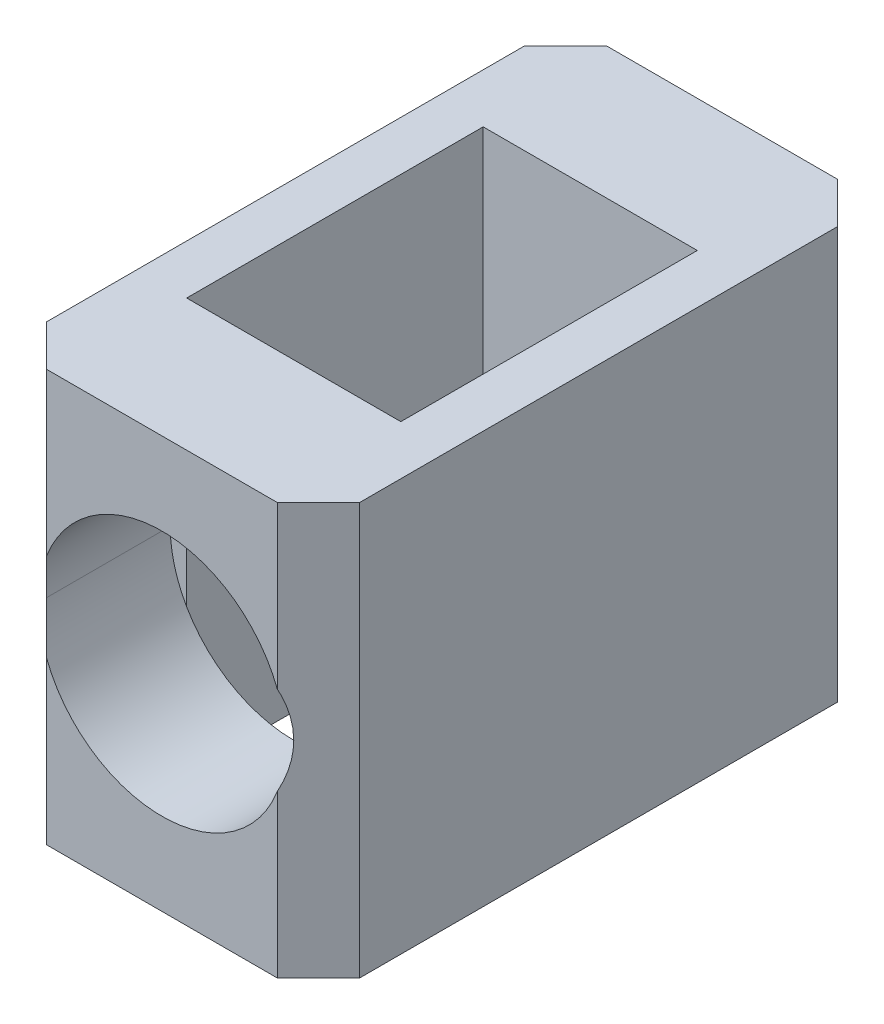
ISO-10303-21;
HEADER;
FILE_DESCRIPTION(('STEP AP214'),'2;1');
FILE_NAME('part.step','',(''),(''),'','','');
FILE_SCHEMA(('AUTOMOTIVE_DESIGN { 1 0 10303 214 1 1 1 1 }'));
ENDSEC;
DATA;
#1=APPLICATION_CONTEXT('core data for automotive mechanical design processes');
#2=APPLICATION_PROTOCOL_DEFINITION('international standard','automotive_design',2000,#1);
#3=PRODUCT_CONTEXT('',#1,'mechanical');
#4=PRODUCT('Part','Part','',(#3));
#5=PRODUCT_RELATED_PRODUCT_CATEGORY('part','',(#4));
#6=PRODUCT_DEFINITION_FORMATION('','',#4);
#7=PRODUCT_DEFINITION_CONTEXT('part definition',#1,'design');
#8=PRODUCT_DEFINITION('design','',#6,#7);
#9=PRODUCT_DEFINITION_SHAPE('','',#8);
#10=(LENGTH_UNIT() NAMED_UNIT(*) SI_UNIT(.MILLI.,.METRE.));
#11=(NAMED_UNIT(*) PLANE_ANGLE_UNIT() SI_UNIT($,.RADIAN.));
#12=(NAMED_UNIT(*) SI_UNIT($,.STERADIAN.) SOLID_ANGLE_UNIT());
#13=UNCERTAINTY_MEASURE_WITH_UNIT(LENGTH_MEASURE(1.E-05),#10,'distance_accuracy_value','');
#14=(GEOMETRIC_REPRESENTATION_CONTEXT(3) GLOBAL_UNCERTAINTY_ASSIGNED_CONTEXT((#13)) GLOBAL_UNIT_ASSIGNED_CONTEXT((#10,
#11,#12)) REPRESENTATION_CONTEXT('',''));
#15=CARTESIAN_POINT('',(0.,0.,0.));
#16=DIRECTION('',(0.,0.,1.));
#17=DIRECTION('',(1.,0.,0.));
#18=AXIS2_PLACEMENT_3D('',#15,#16,#17);
#19=CARTESIAN_POINT('',(17.7799999999997,5.27000000000021,8.43));
#20=DIRECTION('',(0.,0.,-1.));
#21=DIRECTION('',(-1.,0.,0.));
#22=AXIS2_PLACEMENT_3D('',#19,#20,#21);
#23=CYLINDRICAL_SURFACE('',#22,1.5);
#24=DIRECTION('',(0.,0.,1.));
#25=VECTOR('',#24,1.);
#26=CARTESIAN_POINT('',(16.2800000000003,5.26999999999963,8.43));
#27=LINE('',#26,#25);
#28=CARTESIAN_POINT('',(16.2800000000003,5.26999999999963,6.83));
#29=VERTEX_POINT('',#28);
#30=CARTESIAN_POINT('',(16.2800000000003,5.26999999999963,8.33));
#31=VERTEX_POINT('',#30);
#32=EDGE_CURVE('E227',#29,#31,#27,.T.);
#33=ORIENTED_EDGE('',*,*,#32,.F.);
#34=CARTESIAN_POINT('',(17.7799999999997,5.27000000000021,6.82999999999992));
#35=DIRECTION('',(0.,0.,1.));
#36=DIRECTION('',(-1.,0.,0.));
#37=AXIS2_PLACEMENT_3D('',#34,#35,#36);
#38=CIRCLE('',#37,1.5);
#39=CARTESIAN_POINT('',(16.48,6.01833147735468,6.83));
#40=VERTEX_POINT('',#39);
#41=EDGE_CURVE('E28',#40,#29,#38,.T.);
#42=ORIENTED_EDGE('',*,*,#41,.F.);
#43=CARTESIAN_POINT('',(17.7799999999997,5.27000000000021,6.83));
#44=DIRECTION('',(0.,0.,1.));
#45=DIRECTION('',(-1.,0.,0.));
#46=AXIS2_PLACEMENT_3D('',#43,#44,#45);
#47=CIRCLE('',#46,1.5);
#48=CARTESIAN_POINT('',(19.08,6.01833147735475,6.82999999999989));
#49=VERTEX_POINT('',#48);
#50=EDGE_CURVE('E304',#49,#40,#47,.T.);
#51=ORIENTED_EDGE('',*,*,#50,.F.);
#52=CARTESIAN_POINT('',(17.7799999999997,5.27000000000021,6.82999999999992));
#53=DIRECTION('',(0.,0.,1.));
#54=DIRECTION('',(-1.,0.,0.));
#55=AXIS2_PLACEMENT_3D('',#52,#53,#54);
#56=CIRCLE('',#55,1.5);
#57=CARTESIAN_POINT('',(19.28,5.27000000000007,6.82999999999989));
#58=VERTEX_POINT('',#57);
#59=EDGE_CURVE('E11',#58,#49,#56,.T.);
#60=ORIENTED_EDGE('',*,*,#59,.F.);
#61=DIRECTION('',(0.,0.,1.));
#62=VECTOR('',#61,1.);
#63=CARTESIAN_POINT('',(19.28,5.27000000000007,8.43));
#64=LINE('',#63,#62);
#65=CARTESIAN_POINT('',(19.28,5.27000000000007,8.32999999999989));
#66=VERTEX_POINT('',#65);
#67=EDGE_CURVE('E238',#58,#66,#64,.T.);
#68=ORIENTED_EDGE('',*,*,#67,.T.);
#69=CARTESIAN_POINT('',(17.7799999999997,5.27000000000021,9.83));
#70=DIRECTION('',(0.707106781186561,0.,0.707106781186534));
#71=DIRECTION('',(-0.707106781186534,0.,0.707106781186561));
#72=AXIS2_PLACEMENT_3D('',#69,#70,#71);
#73=ELLIPSE('',#72,2.12132034355964,1.5);
#74=CARTESIAN_POINT('',(19.18,5.80851648071365,8.43));
#75=VERTEX_POINT('',#74);
#76=EDGE_CURVE('E222',#66,#75,#73,.T.);
#77=ORIENTED_EDGE('',*,*,#76,.T.);
#78=CARTESIAN_POINT('',(17.7799999999997,5.27000000000021,8.43));
#79=DIRECTION('',(0.,0.,1.));
#80=DIRECTION('',(-1.,0.,0.));
#81=AXIS2_PLACEMENT_3D('',#78,#79,#80);
#82=CIRCLE('',#81,1.5);
#83=CARTESIAN_POINT('',(16.38,5.80851648071329,8.43));
#84=VERTEX_POINT('',#83);
#85=EDGE_CURVE('E299',#75,#84,#82,.T.);
#86=ORIENTED_EDGE('',*,*,#85,.T.);
#87=CARTESIAN_POINT('',(17.7799999999997,5.27000000000021,9.83));
#88=DIRECTION('',(-0.707106781186535,0.,0.70710678118656));
#89=DIRECTION('',(0.70710678118656,0.,0.707106781186535));
#90=AXIS2_PLACEMENT_3D('',#87,#88,#89);
#91=ELLIPSE('',#90,2.12132034355964,1.5);
#92=EDGE_CURVE('E286',#84,#31,#91,.T.);
#93=ORIENTED_EDGE('',*,*,#92,.T.);
#94=EDGE_LOOP('',(#33,#42,#51,#60,#68,#77,#86,#93));
#95=FACE_BOUND('',#94,.T.);
#96=ADVANCED_FACE('F17',(#95),#23,.F.);
#97=CARTESIAN_POINT('',(19.1050000000003,5.26999999999963,6.82999999999989));
#98=DIRECTION('',(0.,0.,1.));
#99=DIRECTION('',(1.,0.,0.));
#100=AXIS2_PLACEMENT_3D('',#97,#98,#99);
#101=PLANE('',#100);
#102=DIRECTION('',(0.,-1.,0.));
#103=VECTOR('',#102,1.);
#104=CARTESIAN_POINT('',(19.08,2.77000000000016,6.82999999999989));
#105=LINE('',#104,#103);
#106=CARTESIAN_POINT('',(19.08,4.52166852264494,6.82999999999989));
#107=VERTEX_POINT('',#106);
#108=EDGE_CURVE('E265',#49,#107,#105,.T.);
#109=ORIENTED_EDGE('',*,*,#108,.T.);
#110=CARTESIAN_POINT('',(17.7799999999997,5.27000000000021,6.82999999999992));
#111=DIRECTION('',(0.,0.,1.));
#112=DIRECTION('',(-1.,0.,0.));
#113=AXIS2_PLACEMENT_3D('',#110,#111,#112);
#114=CIRCLE('',#113,1.5);
#115=EDGE_CURVE('E235',#107,#58,#114,.T.);
#116=ORIENTED_EDGE('',*,*,#115,.T.);
#117=ORIENTED_EDGE('',*,*,#59,.T.);
#118=EDGE_LOOP('',(#109,#116,#117));
#119=FACE_BOUND('',#118,.T.);
#120=ADVANCED_FACE('F435',(#119),#101,.T.);
#121=CARTESIAN_POINT('',(19.1050000000003,5.26999999999963,6.82999999999989));
#122=DIRECTION('',(0.,0.,1.));
#123=DIRECTION('',(1.,0.,0.));
#124=AXIS2_PLACEMENT_3D('',#121,#122,#123);
#125=PLANE('',#124);
#126=CARTESIAN_POINT('',(17.7799999999997,5.27000000000021,6.82999999999992));
#127=DIRECTION('',(0.,0.,1.));
#128=DIRECTION('',(-1.,0.,0.));
#129=AXIS2_PLACEMENT_3D('',#126,#127,#128);
#130=CIRCLE('',#129,1.5);
#131=CARTESIAN_POINT('',(16.48,4.52166852264501,6.83));
#132=VERTEX_POINT('',#131);
#133=EDGE_CURVE('E224',#29,#132,#130,.T.);
#134=ORIENTED_EDGE('',*,*,#133,.T.);
#135=DIRECTION('',(0.,1.,0.));
#136=VECTOR('',#135,1.);
#137=CARTESIAN_POINT('',(16.48,2.77000000000016,6.83));
#138=LINE('',#137,#136);
#139=EDGE_CURVE('E234',#132,#40,#138,.T.);
#140=ORIENTED_EDGE('',*,*,#139,.T.);
#141=ORIENTED_EDGE('',*,*,#41,.T.);
#142=EDGE_LOOP('',(#134,#140,#141));
#143=FACE_BOUND('',#142,.T.);
#144=ADVANCED_FACE('F370',(#143),#125,.T.);
#145=CARTESIAN_POINT('',(17.7799999999997,5.27000000000021,8.43));
#146=DIRECTION('',(0.,0.,-1.));
#147=DIRECTION('',(-1.,0.,0.));
#148=AXIS2_PLACEMENT_3D('',#145,#146,#147);
#149=CYLINDRICAL_SURFACE('',#148,1.5);
#150=ORIENTED_EDGE('',*,*,#133,.F.);
#151=ORIENTED_EDGE('',*,*,#32,.T.);
#152=CARTESIAN_POINT('',(17.7799999999997,5.27000000000021,9.83));
#153=DIRECTION('',(-0.707106781186535,0.,0.70710678118656));
#154=DIRECTION('',(0.70710678118656,0.,0.707106781186535));
#155=AXIS2_PLACEMENT_3D('',#152,#153,#154);
#156=ELLIPSE('',#155,2.12132034355964,1.5);
#157=CARTESIAN_POINT('',(16.38,4.73148351928682,8.43));
#158=VERTEX_POINT('',#157);
#159=EDGE_CURVE('E280',#31,#158,#156,.T.);
#160=ORIENTED_EDGE('',*,*,#159,.T.);
#161=CARTESIAN_POINT('',(17.7799999999997,5.27000000000021,8.43));
#162=DIRECTION('',(0.,0.,1.));
#163=DIRECTION('',(-1.,0.,0.));
#164=AXIS2_PLACEMENT_3D('',#161,#162,#163);
#165=CIRCLE('',#164,1.5);
#166=CARTESIAN_POINT('',(19.18,4.73148351928624,8.43));
#167=VERTEX_POINT('',#166);
#168=EDGE_CURVE('E239',#158,#167,#165,.T.);
#169=ORIENTED_EDGE('',*,*,#168,.T.);
#170=CARTESIAN_POINT('',(17.7799999999997,5.27000000000021,9.83));
#171=DIRECTION('',(0.707106781186561,0.,0.707106781186534));
#172=DIRECTION('',(-0.707106781186534,0.,0.707106781186561));
#173=AXIS2_PLACEMENT_3D('',#170,#171,#172);
#174=ELLIPSE('',#173,2.12132034355964,1.5);
#175=EDGE_CURVE('E277',#167,#66,#174,.T.);
#176=ORIENTED_EDGE('',*,*,#175,.T.);
#177=ORIENTED_EDGE('',*,*,#67,.F.);
#178=ORIENTED_EDGE('',*,*,#115,.F.);
#179=CARTESIAN_POINT('',(17.7799999999997,5.27000000000021,6.83));
#180=DIRECTION('',(0.,0.,1.));
#181=DIRECTION('',(-1.,0.,0.));
#182=AXIS2_PLACEMENT_3D('',#179,#180,#181);
#183=CIRCLE('',#182,1.5);
#184=EDGE_CURVE('E228',#132,#107,#183,.T.);
#185=ORIENTED_EDGE('',*,*,#184,.F.);
#186=EDGE_LOOP('',(#150,#151,#160,#169,#176,#177,#178,#185));
#187=FACE_BOUND('',#186,.T.);
#188=ADVANCED_FACE('F715',(#187),#149,.F.);
#189=CARTESIAN_POINT('',(18.7799999999996,7.77000000000033,6.83));
#190=DIRECTION('',(0.,0.,1.));
#191=DIRECTION('',(1.,0.,0.));
#192=AXIS2_PLACEMENT_3D('',#189,#190,#191);
#193=PLANE('',#192);
#194=ORIENTED_EDGE('',*,*,#184,.T.);
#195=DIRECTION('',(0.,1.,0.));
#196=VECTOR('',#195,1.);
#197=CARTESIAN_POINT('',(19.08,2.77000000000016,6.83));
#198=LINE('',#197,#196);
#199=CARTESIAN_POINT('',(19.08,2.77000000000016,6.83));
#200=VERTEX_POINT('',#199);
#201=EDGE_CURVE('E270',#200,#107,#198,.T.);
#202=ORIENTED_EDGE('',*,*,#201,.F.);
#203=DIRECTION('',(1.,0.,0.));
#204=VECTOR('',#203,1.);
#205=CARTESIAN_POINT('',(75.6910968965142,2.7700000000002,6.82999999999898));
#206=LINE('',#205,#204);
#207=CARTESIAN_POINT('',(16.48,2.77000000000016,6.83));
#208=VERTEX_POINT('',#207);
#209=EDGE_CURVE('E219',#208,#200,#206,.T.);
#210=ORIENTED_EDGE('',*,*,#209,.F.);
#211=DIRECTION('',(0.,1.,0.));
#212=VECTOR('',#211,1.);
#213=CARTESIAN_POINT('',(16.48,2.77000000000016,6.83));
#214=LINE('',#213,#212);
#215=EDGE_CURVE('E229',#208,#132,#214,.T.);
#216=ORIENTED_EDGE('',*,*,#215,.T.);
#217=EDGE_LOOP('',(#194,#202,#210,#216));
#218=FACE_BOUND('',#217,.T.);
#219=ADVANCED_FACE('F432',(#218),#193,.F.);
#220=CARTESIAN_POINT('',(16.1300000000003,5.26999999999964,8.18));
#221=DIRECTION('',(-0.707106781186534,0.,0.707106781186561));
#222=DIRECTION('',(0.,1.,0.));
#223=AXIS2_PLACEMENT_3D('',#220,#221,#222);
#224=PLANE('',#223);
#225=DIRECTION('',(0.,1.,0.));
#226=VECTOR('',#225,1.);
#227=CARTESIAN_POINT('',(15.88,5.26999999999984,7.93));
#228=LINE('',#227,#226);
#229=CARTESIAN_POINT('',(15.88,2.77000000000016,7.93));
#230=VERTEX_POINT('',#229);
#231=CARTESIAN_POINT('',(15.8800000000003,7.76999999999961,7.93));
#232=VERTEX_POINT('',#231);
#233=EDGE_CURVE('E258',#230,#232,#228,.T.);
#234=ORIENTED_EDGE('',*,*,#233,.F.);
#235=DIRECTION('',(-0.70710678118656,0.,-0.707106781186535));
#236=VECTOR('',#235,1.);
#237=CARTESIAN_POINT('',(-46.8400768086941,2.76999999999905,-54.7900768086914));
#238=LINE('',#237,#236);
#239=CARTESIAN_POINT('',(16.3800000000003,2.76999999999965,8.43));
#240=VERTEX_POINT('',#239);
#241=EDGE_CURVE('E248',#240,#230,#238,.T.);
#242=ORIENTED_EDGE('',*,*,#241,.F.);
#243=DIRECTION('',(0.,1.,0.));
#244=VECTOR('',#243,1.);
#245=CARTESIAN_POINT('',(16.38,5.27000000000006,8.43));
#246=LINE('',#245,#244);
#247=EDGE_CURVE('E243',#240,#158,#246,.T.);
#248=ORIENTED_EDGE('',*,*,#247,.T.);
#249=ORIENTED_EDGE('',*,*,#159,.F.);
#250=ORIENTED_EDGE('',*,*,#92,.F.);
#251=DIRECTION('',(0.,1.,0.));
#252=VECTOR('',#251,1.);
#253=CARTESIAN_POINT('',(16.38,5.27000000000006,8.43));
#254=LINE('',#253,#252);
#255=CARTESIAN_POINT('',(16.38,7.76999999999983,8.43));
#256=VERTEX_POINT('',#255);
#257=EDGE_CURVE('E249',#84,#256,#254,.T.);
#258=ORIENTED_EDGE('',*,*,#257,.T.);
#259=DIRECTION('',(-0.70710678118656,0.,-0.707106781186535));
#260=VECTOR('',#259,1.);
#261=CARTESIAN_POINT('',(-46.8400768086941,7.76999999999941,-54.7900768086914));
#262=LINE('',#261,#260);
#263=EDGE_CURVE('E210',#256,#232,#262,.T.);
#264=ORIENTED_EDGE('',*,*,#263,.T.);
#265=EDGE_LOOP('',(#234,#242,#248,#249,#250,#258,#264));
#266=FACE_BOUND('',#265,.T.);
#267=ADVANCED_FACE('F396',(#266),#224,.T.);
#268=CARTESIAN_POINT('',(19.43,5.27,8.18));
#269=DIRECTION('',(0.70710678118656,0.,0.707106781186535));
#270=DIRECTION('',(0.,-1.,0.));
#271=AXIS2_PLACEMENT_3D('',#268,#269,#270);
#272=PLANE('',#271);
#273=DIRECTION('',(0.,-1.,0.));
#274=VECTOR('',#273,1.);
#275=CARTESIAN_POINT('',(19.68,5.26999999999985,7.93));
#276=LINE('',#275,#274);
#277=CARTESIAN_POINT('',(19.6799999999997,7.77000000000023,7.93));
#278=VERTEX_POINT('',#277);
#279=CARTESIAN_POINT('',(19.68,2.77000000000009,7.93));
#280=VERTEX_POINT('',#279);
#281=EDGE_CURVE('E200',#278,#280,#276,.T.);
#282=ORIENTED_EDGE('',*,*,#281,.F.);
#283=DIRECTION('',(-0.707106781186534,0.,0.707106781186561));
#284=VECTOR('',#283,1.);
#285=CARTESIAN_POINT('',(82.4000768086914,7.77000000000049,-54.7900768086937));
#286=LINE('',#285,#284);
#287=CARTESIAN_POINT('',(19.18,7.77,8.43));
#288=VERTEX_POINT('',#287);
#289=EDGE_CURVE('E178',#278,#288,#286,.T.);
#290=ORIENTED_EDGE('',*,*,#289,.T.);
#291=DIRECTION('',(0.,-1.,0.));
#292=VECTOR('',#291,1.);
#293=CARTESIAN_POINT('',(19.1800000000004,5.26999999999964,8.43));
#294=LINE('',#293,#292);
#295=EDGE_CURVE('E303',#288,#75,#294,.T.);
#296=ORIENTED_EDGE('',*,*,#295,.T.);
#297=ORIENTED_EDGE('',*,*,#76,.F.);
#298=ORIENTED_EDGE('',*,*,#175,.F.);
#299=DIRECTION('',(0.,-1.,0.));
#300=VECTOR('',#299,1.);
#301=CARTESIAN_POINT('',(19.1800000000004,5.26999999999964,8.43));
#302=LINE('',#301,#300);
#303=CARTESIAN_POINT('',(19.18,2.76999999999987,8.43));
#304=VERTEX_POINT('',#303);
#305=EDGE_CURVE('E244',#167,#304,#302,.T.);
#306=ORIENTED_EDGE('',*,*,#305,.T.);
#307=DIRECTION('',(-0.707106781186534,0.,0.707106781186561));
#308=VECTOR('',#307,1.);
#309=CARTESIAN_POINT('',(82.4000768086915,2.77000000000048,-54.7900768086937));
#310=LINE('',#309,#308);
#311=EDGE_CURVE('E245',#280,#304,#310,.T.);
#312=ORIENTED_EDGE('',*,*,#311,.F.);
#313=EDGE_LOOP('',(#282,#290,#296,#297,#298,#306,#312));
#314=FACE_BOUND('',#313,.T.);
#315=ADVANCED_FACE('F532',(#314),#272,.T.);
#316=CARTESIAN_POINT('',(16.13,5.26999999999964,1.87999999999996));
#317=DIRECTION('',(-0.70710678118656,0.,-0.707106781186535));
#318=DIRECTION('',(-0.707106781186535,0.,0.70710678118656));
#319=AXIS2_PLACEMENT_3D('',#316,#317,#318);
#320=PLANE('',#319);
#321=DIRECTION('',(0.,-1.,0.));
#322=VECTOR('',#321,1.);
#323=CARTESIAN_POINT('',(15.88,5.26999999999984,2.12999999999996));
#324=LINE('',#323,#322);
#325=CARTESIAN_POINT('',(15.88,7.76999999999961,2.13000000000006));
#326=VERTEX_POINT('',#325);
#327=CARTESIAN_POINT('',(15.8799999999997,2.77000000000016,2.13000000000006));
#328=VERTEX_POINT('',#327);
#329=EDGE_CURVE('E264',#326,#328,#324,.T.);
#330=ORIENTED_EDGE('',*,*,#329,.F.);
#331=DIRECTION('',(0.707106781186534,0.,-0.707106781186561));
#332=VECTOR('',#331,1.);
#333=CARTESIAN_POINT('',(72.8000768086915,7.77000000000034,-54.7900768086936));
#334=LINE('',#333,#332);
#335=CARTESIAN_POINT('',(16.38,7.76999999999983,1.63000000000004));
#336=VERTEX_POINT('',#335);
#337=EDGE_CURVE('E206',#326,#336,#334,.T.);
#338=ORIENTED_EDGE('',*,*,#337,.T.);
#339=DIRECTION('',(0.,-1.,0.));
#340=VECTOR('',#339,1.);
#341=CARTESIAN_POINT('',(16.3799999999997,5.27000000000006,1.62999999999994));
#342=LINE('',#341,#340);
#343=CARTESIAN_POINT('',(16.38,2.76999999999965,1.63000000000004));
#344=VERTEX_POINT('',#343);
#345=EDGE_CURVE('E307',#336,#344,#342,.T.);
#346=ORIENTED_EDGE('',*,*,#345,.T.);
#347=DIRECTION('',(0.707106781186534,0.,-0.707106781186561));
#348=VECTOR('',#347,1.);
#349=CARTESIAN_POINT('',(72.8000768086917,2.77000000000019,-54.7900768086936));
#350=LINE('',#349,#348);
#351=EDGE_CURVE('E276',#328,#344,#350,.T.);
#352=ORIENTED_EDGE('',*,*,#351,.F.);
#353=EDGE_LOOP('',(#330,#338,#346,#352));
#354=FACE_BOUND('',#353,.T.);
#355=ADVANCED_FACE('F403',(#354),#320,.T.);
#356=CARTESIAN_POINT('',(19.43,5.27,1.87999999999989));
#357=DIRECTION('',(0.707106781186535,0.,-0.707106781186561));
#358=DIRECTION('',(0.,-1.,0.));
#359=AXIS2_PLACEMENT_3D('',#356,#357,#358);
#360=PLANE('',#359);
#361=DIRECTION('',(0.,-1.,0.));
#362=VECTOR('',#361,1.);
#363=CARTESIAN_POINT('',(19.18,5.26999999999964,1.6299999999999));
#364=LINE('',#363,#362);
#365=CARTESIAN_POINT('',(19.1799999999997,7.77,1.63));
#366=VERTEX_POINT('',#365);
#367=CARTESIAN_POINT('',(19.18,2.76999999999987,1.63));
#368=VERTEX_POINT('',#367);
#369=EDGE_CURVE('E172',#366,#368,#364,.T.);
#370=ORIENTED_EDGE('',*,*,#369,.F.);
#371=DIRECTION('',(0.70710678118656,0.,0.707106781186535));
#372=VECTOR('',#371,1.);
#373=CARTESIAN_POINT('',(-37.2400768086939,7.76999999999941,-54.7900768086916));
#374=LINE('',#373,#372);
#375=CARTESIAN_POINT('',(19.6799999999996,7.77000000000023,2.13));
#376=VERTEX_POINT('',#375);
#377=EDGE_CURVE('E165',#366,#376,#374,.T.);
#378=ORIENTED_EDGE('',*,*,#377,.T.);
#379=DIRECTION('',(0.,-1.,0.));
#380=VECTOR('',#379,1.);
#381=CARTESIAN_POINT('',(19.68,5.26999999999985,2.12999999999989));
#382=LINE('',#381,#380);
#383=CARTESIAN_POINT('',(19.68,2.77000000000009,2.13));
#384=VERTEX_POINT('',#383);
#385=EDGE_CURVE('E169',#376,#384,#382,.T.);
#386=ORIENTED_EDGE('',*,*,#385,.T.);
#387=DIRECTION('',(0.70710678118656,0.,0.707106781186535));
#388=VECTOR('',#387,1.);
#389=CARTESIAN_POINT('',(-37.2400768086939,2.76999999999905,-54.7900768086916));
#390=LINE('',#389,#388);
#391=EDGE_CURVE('E223',#368,#384,#390,.T.);
#392=ORIENTED_EDGE('',*,*,#391,.F.);
#393=EDGE_LOOP('',(#370,#378,#386,#392));
#394=FACE_BOUND('',#393,.T.);
#395=ADVANCED_FACE('F167',(#394),#360,.T.);
#396=CARTESIAN_POINT('',(75.691096896513,2.77000000000019,-54.7900768086936));
#397=DIRECTION('',(0.,1.,0.));
#398=DIRECTION('',(1.,0.,0.));
#399=AXIS2_PLACEMENT_3D('',#396,#397,#398);
#400=PLANE('',#399);
#401=DIRECTION('',(0.,0.,1.));
#402=VECTOR('',#401,1.);
#403=CARTESIAN_POINT('',(16.4799999999988,2.77000000000015,-54.7900768086926));
#404=LINE('',#403,#402);
#405=CARTESIAN_POINT('',(16.48,2.77000000000016,3.22999999999994));
#406=VERTEX_POINT('',#405);
#407=EDGE_CURVE('E233',#406,#208,#404,.T.);
#408=ORIENTED_EDGE('',*,*,#407,.T.);
#409=ORIENTED_EDGE('',*,*,#209,.T.);
#410=DIRECTION('',(0.,0.,-1.));
#411=VECTOR('',#410,1.);
#412=CARTESIAN_POINT('',(19.0799999999987,2.77000000000015,-54.7900768086926));
#413=LINE('',#412,#411);
#414=CARTESIAN_POINT('',(19.08,2.77000000000016,3.22999999999989));
#415=VERTEX_POINT('',#414);
#416=EDGE_CURVE('E21',#200,#415,#413,.T.);
#417=ORIENTED_EDGE('',*,*,#416,.T.);
#418=DIRECTION('',(-1.,0.,0.));
#419=VECTOR('',#418,1.);
#420=CARTESIAN_POINT('',(75.6910968965141,2.7700000000002,3.22999999999887));
#421=LINE('',#420,#419);
#422=EDGE_CURVE('E215',#415,#406,#421,.T.);
#423=ORIENTED_EDGE('',*,*,#422,.T.);
#424=EDGE_LOOP('',(#408,#409,#417,#423));
#425=FACE_BOUND('',#424,.T.);
#426=DIRECTION('',(0.,0.,-1.));
#427=VECTOR('',#426,1.);
#428=CARTESIAN_POINT('',(19.6799999999988,2.77000000000008,-54.7900768086926));
#429=LINE('',#428,#427);
#430=EDGE_CURVE('E193',#280,#384,#429,.T.);
#431=ORIENTED_EDGE('',*,*,#430,.F.);
#432=ORIENTED_EDGE('',*,*,#311,.T.);
#433=DIRECTION('',(-1.,0.,0.));
#434=VECTOR('',#433,1.);
#435=CARTESIAN_POINT('',(75.6910968965142,2.7700000000002,8.42999999999897));
#436=LINE('',#435,#434);
#437=EDGE_CURVE('E218',#304,#240,#436,.T.);
#438=ORIENTED_EDGE('',*,*,#437,.T.);
#439=ORIENTED_EDGE('',*,*,#241,.T.);
#440=DIRECTION('',(0.,0.,-1.));
#441=VECTOR('',#440,1.);
#442=CARTESIAN_POINT('',(15.8799999999987,2.77000000000016,-54.7900768086925));
#443=LINE('',#442,#441);
#444=EDGE_CURVE('E287',#230,#328,#443,.T.);
#445=ORIENTED_EDGE('',*,*,#444,.T.);
#446=ORIENTED_EDGE('',*,*,#351,.T.);
#447=DIRECTION('',(-1.,0.,0.));
#448=VECTOR('',#447,1.);
#449=CARTESIAN_POINT('',(75.6910968965141,2.7700000000002,1.62999999999888));
#450=LINE('',#449,#448);
#451=EDGE_CURVE('E311',#368,#344,#450,.T.);
#452=ORIENTED_EDGE('',*,*,#451,.F.);
#453=ORIENTED_EDGE('',*,*,#391,.T.);
#454=EDGE_LOOP('',(#431,#432,#438,#439,#445,#446,#452,#453));
#455=FACE_BOUND('',#454,.T.);
#456=ADVANCED_FACE('F390',(#425,#455),#400,.F.);
#457=CARTESIAN_POINT('',(18.9800000000003,2.76999999999965,8.43));
#458=DIRECTION('',(0.,0.,1.));
#459=DIRECTION('',(1.,0.,0.));
#460=AXIS2_PLACEMENT_3D('',#457,#458,#459);
#461=PLANE('',#460);
#462=ORIENTED_EDGE('',*,*,#85,.F.);
#463=ORIENTED_EDGE('',*,*,#295,.F.);
#464=DIRECTION('',(-1.,0.,0.));
#465=VECTOR('',#464,1.);
#466=CARTESIAN_POINT('',(75.691096896514,7.77000000000035,8.42999999999897));
#467=LINE('',#466,#465);
#468=EDGE_CURVE('E317',#288,#256,#467,.T.);
#469=ORIENTED_EDGE('',*,*,#468,.T.);
#470=ORIENTED_EDGE('',*,*,#257,.F.);
#471=EDGE_LOOP('',(#462,#463,#469,#470));
#472=FACE_BOUND('',#471,.T.);
#473=ADVANCED_FACE('F528',(#472),#461,.T.);
#474=CARTESIAN_POINT('',(18.7799999999996,7.77000000000033,6.83));
#475=DIRECTION('',(0.,0.,1.));
#476=DIRECTION('',(1.,0.,0.));
#477=AXIS2_PLACEMENT_3D('',#474,#475,#476);
#478=PLANE('',#477);
#479=DIRECTION('',(0.,1.,0.));
#480=VECTOR('',#479,1.);
#481=CARTESIAN_POINT('',(19.08,2.77000000000016,6.83));
#482=LINE('',#481,#480);
#483=CARTESIAN_POINT('',(19.0799999999996,7.77000000000031,6.83));
#484=VERTEX_POINT('',#483);
#485=EDGE_CURVE('E269',#49,#484,#482,.T.);
#486=ORIENTED_EDGE('',*,*,#485,.F.);
#487=ORIENTED_EDGE('',*,*,#50,.T.);
#488=DIRECTION('',(0.,1.,0.));
#489=VECTOR('',#488,1.);
#490=CARTESIAN_POINT('',(16.48,2.77000000000016,6.83));
#491=LINE('',#490,#489);
#492=CARTESIAN_POINT('',(16.4799999999997,7.77000000000031,6.83));
#493=VERTEX_POINT('',#492);
#494=EDGE_CURVE('E204',#40,#493,#491,.T.);
#495=ORIENTED_EDGE('',*,*,#494,.T.);
#496=DIRECTION('',(1.,0.,0.));
#497=VECTOR('',#496,1.);
#498=CARTESIAN_POINT('',(75.6910968965139,7.77000000000035,6.82999999999898));
#499=LINE('',#498,#497);
#500=EDGE_CURVE('E177',#493,#484,#499,.T.);
#501=ORIENTED_EDGE('',*,*,#500,.T.);
#502=EDGE_LOOP('',(#486,#487,#495,#501));
#503=FACE_BOUND('',#502,.T.);
#504=ADVANCED_FACE('F364',(#503),#478,.F.);
#505=CARTESIAN_POINT('',(16.58,2.76999999999987,1.62999999999994));
#506=DIRECTION('',(0.,0.,-1.));
#507=DIRECTION('',(-1.,0.,0.));
#508=AXIS2_PLACEMENT_3D('',#505,#506,#507);
#509=PLANE('',#508);
#510=ORIENTED_EDGE('',*,*,#369,.T.);
#511=ORIENTED_EDGE('',*,*,#451,.T.);
#512=ORIENTED_EDGE('',*,*,#345,.F.);
#513=DIRECTION('',(-1.,0.,0.));
#514=VECTOR('',#513,1.);
#515=CARTESIAN_POINT('',(75.6910968965138,7.77000000000035,1.62999999999888));
#516=LINE('',#515,#514);
#517=EDGE_CURVE('E189',#366,#336,#516,.T.);
#518=ORIENTED_EDGE('',*,*,#517,.F.);
#519=EDGE_LOOP('',(#510,#511,#512,#518));
#520=FACE_BOUND('',#519,.T.);
#521=ADVANCED_FACE('F19',(#520),#509,.T.);
#522=CARTESIAN_POINT('',(16.7716410670894,7.76999999999981,7.62205114905214));
#523=DIRECTION('',(0.,1.,0.));
#524=DIRECTION('',(1.,0.,0.));
#525=AXIS2_PLACEMENT_3D('',#522,#523,#524);
#526=PLANE('',#525);
#527=DIRECTION('',(-1.,0.,0.));
#528=VECTOR('',#527,1.);
#529=CARTESIAN_POINT('',(75.6910968965139,7.77000000000035,3.22999999999887));
#530=LINE('',#529,#528);
#531=CARTESIAN_POINT('',(19.0799999999995,7.77000000000031,3.22999999999989));
#532=VERTEX_POINT('',#531);
#533=CARTESIAN_POINT('',(16.4799999999996,7.77000000000031,3.22999999999994));
#534=VERTEX_POINT('',#533);
#535=EDGE_CURVE('E254',#532,#534,#530,.T.);
#536=ORIENTED_EDGE('',*,*,#535,.F.);
#537=DIRECTION('',(0.,0.,-1.));
#538=VECTOR('',#537,1.);
#539=CARTESIAN_POINT('',(19.0799999999985,7.7700000000003,-54.7900768086926));
#540=LINE('',#539,#538);
#541=EDGE_CURVE('E253',#484,#532,#540,.T.);
#542=ORIENTED_EDGE('',*,*,#541,.F.);
#543=ORIENTED_EDGE('',*,*,#500,.F.);
#544=DIRECTION('',(0.,0.,1.));
#545=VECTOR('',#544,1.);
#546=CARTESIAN_POINT('',(16.4799999999985,7.7700000000003,-54.7900768086926));
#547=LINE('',#546,#545);
#548=EDGE_CURVE('E291',#534,#493,#547,.T.);
#549=ORIENTED_EDGE('',*,*,#548,.F.);
#550=EDGE_LOOP('',(#536,#542,#543,#549));
#551=FACE_BOUND('',#550,.T.);
#552=ORIENTED_EDGE('',*,*,#517,.T.);
#553=ORIENTED_EDGE('',*,*,#337,.F.);
#554=DIRECTION('',(0.,0.,-1.));
#555=VECTOR('',#554,1.);
#556=CARTESIAN_POINT('',(15.8799999999992,7.7699999999996,-54.7900768086925));
#557=LINE('',#556,#555);
#558=EDGE_CURVE('E260',#232,#326,#557,.T.);
#559=ORIENTED_EDGE('',*,*,#558,.F.);
#560=ORIENTED_EDGE('',*,*,#263,.F.);
#561=ORIENTED_EDGE('',*,*,#468,.F.);
#562=ORIENTED_EDGE('',*,*,#289,.F.);
#563=DIRECTION('',(0.,0.,-1.));
#564=VECTOR('',#563,1.);
#565=CARTESIAN_POINT('',(19.6799999999986,7.77000000000022,-54.7900768086926));
#566=LINE('',#565,#564);
#567=EDGE_CURVE('E181',#278,#376,#566,.T.);
#568=ORIENTED_EDGE('',*,*,#567,.T.);
#569=ORIENTED_EDGE('',*,*,#377,.F.);
#570=EDGE_LOOP('',(#552,#553,#559,#560,#561,#562,#568,#569));
#571=FACE_BOUND('',#570,.T.);
#572=ADVANCED_FACE('F182',(#551,#571),#526,.T.);
#573=CARTESIAN_POINT('',(19.68,2.77000000000009,2.33));
#574=DIRECTION('',(1.,0.,0.));
#575=DIRECTION('',(0.,0.,-1.));
#576=AXIS2_PLACEMENT_3D('',#573,#574,#575);
#577=PLANE('',#576);
#578=ORIENTED_EDGE('',*,*,#281,.T.);
#579=ORIENTED_EDGE('',*,*,#430,.T.);
#580=ORIENTED_EDGE('',*,*,#385,.F.);
#581=ORIENTED_EDGE('',*,*,#567,.F.);
#582=EDGE_LOOP('',(#578,#579,#580,#581));
#583=FACE_BOUND('',#582,.T.);
#584=ADVANCED_FACE('F191',(#583),#577,.T.);
#585=CARTESIAN_POINT('',(18.9800000000003,2.76999999999965,8.43));
#586=DIRECTION('',(0.,0.,1.));
#587=DIRECTION('',(1.,0.,0.));
#588=AXIS2_PLACEMENT_3D('',#585,#586,#587);
#589=PLANE('',#588);
#590=ORIENTED_EDGE('',*,*,#305,.F.);
#591=ORIENTED_EDGE('',*,*,#168,.F.);
#592=ORIENTED_EDGE('',*,*,#247,.F.);
#593=ORIENTED_EDGE('',*,*,#437,.F.);
#594=EDGE_LOOP('',(#590,#591,#592,#593));
#595=FACE_BOUND('',#594,.T.);
#596=ADVANCED_FACE('F733',(#595),#589,.T.);
#597=CARTESIAN_POINT('',(19.0799999999995,7.77000000000031,3.53));
#598=DIRECTION('',(1.,0.,0.));
#599=DIRECTION('',(0.,0.,-1.));
#600=AXIS2_PLACEMENT_3D('',#597,#598,#599);
#601=PLANE('',#600);
#602=DIRECTION('',(0.,1.,0.));
#603=VECTOR('',#602,1.);
#604=CARTESIAN_POINT('',(19.08,2.77000000000016,3.22999999999989));
#605=LINE('',#604,#603);
#606=EDGE_CURVE('E259',#415,#532,#605,.T.);
#607=ORIENTED_EDGE('',*,*,#606,.F.);
#608=ORIENTED_EDGE('',*,*,#416,.F.);
#609=ORIENTED_EDGE('',*,*,#201,.T.);
#610=ORIENTED_EDGE('',*,*,#108,.F.);
#611=ORIENTED_EDGE('',*,*,#485,.T.);
#612=ORIENTED_EDGE('',*,*,#541,.T.);
#613=EDGE_LOOP('',(#607,#608,#609,#610,#611,#612));
#614=FACE_BOUND('',#613,.T.);
#615=ADVANCED_FACE('F426',(#614),#601,.F.);
#616=CARTESIAN_POINT('',(16.4799999999996,7.77000000000031,3.53));
#617=DIRECTION('',(-1.,0.,0.));
#618=DIRECTION('',(0.,1.,0.));
#619=AXIS2_PLACEMENT_3D('',#616,#617,#618);
#620=PLANE('',#619);
#621=ORIENTED_EDGE('',*,*,#548,.T.);
#622=ORIENTED_EDGE('',*,*,#494,.F.);
#623=ORIENTED_EDGE('',*,*,#139,.F.);
#624=ORIENTED_EDGE('',*,*,#215,.F.);
#625=ORIENTED_EDGE('',*,*,#407,.F.);
#626=DIRECTION('',(0.,1.,0.));
#627=VECTOR('',#626,1.);
#628=CARTESIAN_POINT('',(16.48,2.77000000000016,3.22999999999994));
#629=LINE('',#628,#627);
#630=EDGE_CURVE('E211',#406,#534,#629,.T.);
#631=ORIENTED_EDGE('',*,*,#630,.T.);
#632=EDGE_LOOP('',(#621,#622,#623,#624,#625,#631));
#633=FACE_BOUND('',#632,.T.);
#634=ADVANCED_FACE('F378',(#633),#620,.F.);
#635=CARTESIAN_POINT('',(15.88,2.77000000000016,7.73));
#636=DIRECTION('',(-1.,0.,0.));
#637=DIRECTION('',(0.,1.,0.));
#638=AXIS2_PLACEMENT_3D('',#635,#636,#637);
#639=PLANE('',#638);
#640=ORIENTED_EDGE('',*,*,#233,.T.);
#641=ORIENTED_EDGE('',*,*,#558,.T.);
#642=ORIENTED_EDGE('',*,*,#329,.T.);
#643=ORIENTED_EDGE('',*,*,#444,.F.);
#644=EDGE_LOOP('',(#640,#641,#642,#643));
#645=FACE_BOUND('',#644,.T.);
#646=ADVANCED_FACE('F394',(#645),#639,.T.);
#647=CARTESIAN_POINT('',(16.7799999999995,7.77000000000026,3.22999999999994));
#648=DIRECTION('',(0.,0.,-1.));
#649=DIRECTION('',(-1.,0.,0.));
#650=AXIS2_PLACEMENT_3D('',#647,#648,#649);
#651=PLANE('',#650);
#652=ORIENTED_EDGE('',*,*,#630,.F.);
#653=ORIENTED_EDGE('',*,*,#422,.F.);
#654=ORIENTED_EDGE('',*,*,#606,.T.);
#655=ORIENTED_EDGE('',*,*,#535,.T.);
#656=EDGE_LOOP('',(#652,#653,#654,#655));
#657=FACE_BOUND('',#656,.T.);
#658=ADVANCED_FACE('F430',(#657),#651,.F.);
#659=CLOSED_SHELL('',(#96,#120,#144,#188,#219,#267,#315,#355,#395,#456,#473,#504,#521,#572,#584,
#596,#615,#634,#646,#658));
#660=MANIFOLD_SOLID_BREP('B1',#659);
#661=ADVANCED_BREP_SHAPE_REPRESENTATION('',(#18,#660),#14);
#662=SHAPE_DEFINITION_REPRESENTATION(#9,#661);
ENDSEC;
END-ISO-10303-21;
